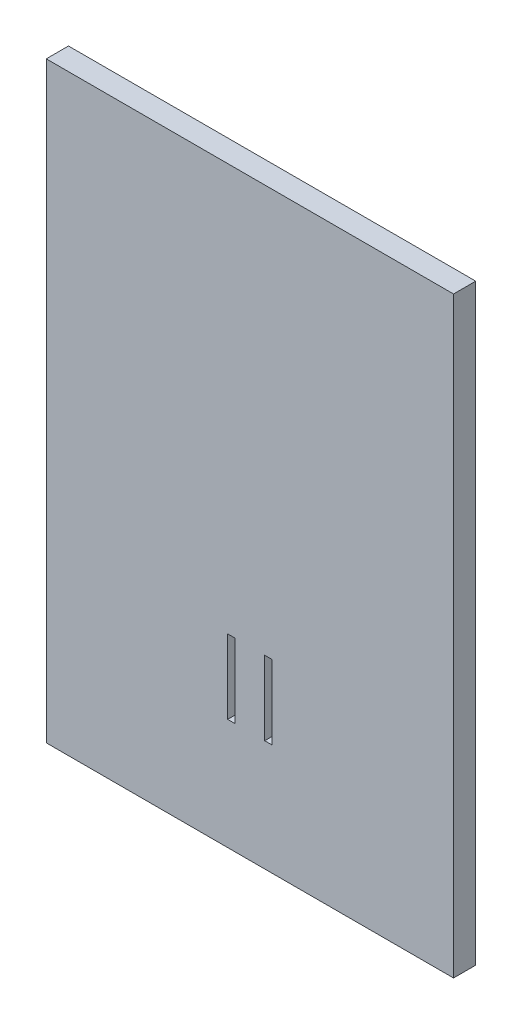
ISO-10303-21;
HEADER;
FILE_DESCRIPTION(('STEP AP214'),'2;1');
FILE_NAME('part.step','',(''),(''),'','','');
FILE_SCHEMA(('AUTOMOTIVE_DESIGN { 1 0 10303 214 1 1 1 1 }'));
ENDSEC;
DATA;
#1=APPLICATION_CONTEXT('core data for automotive mechanical design processes');
#2=APPLICATION_PROTOCOL_DEFINITION('international standard','automotive_design',2000,#1);
#3=PRODUCT_CONTEXT('',#1,'mechanical');
#4=PRODUCT('Part','Part','',(#3));
#5=PRODUCT_RELATED_PRODUCT_CATEGORY('part','',(#4));
#6=PRODUCT_DEFINITION_FORMATION('','',#4);
#7=PRODUCT_DEFINITION_CONTEXT('part definition',#1,'design');
#8=PRODUCT_DEFINITION('design','',#6,#7);
#9=PRODUCT_DEFINITION_SHAPE('','',#8);
#10=(LENGTH_UNIT() NAMED_UNIT(*) SI_UNIT(.MILLI.,.METRE.));
#11=(NAMED_UNIT(*) PLANE_ANGLE_UNIT() SI_UNIT($,.RADIAN.));
#12=(NAMED_UNIT(*) SI_UNIT($,.STERADIAN.) SOLID_ANGLE_UNIT());
#13=UNCERTAINTY_MEASURE_WITH_UNIT(LENGTH_MEASURE(1.E-05),#10,'distance_accuracy_value','');
#14=(GEOMETRIC_REPRESENTATION_CONTEXT(3) GLOBAL_UNCERTAINTY_ASSIGNED_CONTEXT((#13)) GLOBAL_UNIT_ASSIGNED_CONTEXT((#10,
#11,#12)) REPRESENTATION_CONTEXT('',''));
#15=CARTESIAN_POINT('',(0.,0.,0.));
#16=DIRECTION('',(0.,0.,1.));
#17=DIRECTION('',(1.,0.,0.));
#18=AXIS2_PLACEMENT_3D('',#15,#16,#17);
#19=CARTESIAN_POINT('',(0.,0.,3.));
#20=DIRECTION('',(0.,0.,1.));
#21=DIRECTION('',(1.,0.,0.));
#22=AXIS2_PLACEMENT_3D('',#19,#20,#21);
#23=PLANE('',#22);
#24=DIRECTION('',(-1.,0.,0.));
#25=VECTOR('',#24,1.);
#26=CARTESIAN_POINT('',(-1.99999999999999,-15.,3.));
#27=LINE('',#26,#25);
#28=CARTESIAN_POINT('',(-1.99999999999999,-15.,3.));
#29=VERTEX_POINT('',#28);
#30=CARTESIAN_POINT('',(-2.99999999999999,-15.,3.));
#31=VERTEX_POINT('',#30);
#32=EDGE_CURVE('E160',#29,#31,#27,.T.);
#33=ORIENTED_EDGE('',*,*,#32,.F.);
#34=DIRECTION('',(0.,1.,0.));
#35=VECTOR('',#34,1.);
#36=CARTESIAN_POINT('',(-1.99999999999999,-15.,3.));
#37=LINE('',#36,#35);
#38=CARTESIAN_POINT('',(-1.99999999999999,-25.,3.));
#39=VERTEX_POINT('',#38);
#40=EDGE_CURVE('E158',#39,#29,#37,.T.);
#41=ORIENTED_EDGE('',*,*,#40,.F.);
#42=DIRECTION('',(1.,0.,0.));
#43=VECTOR('',#42,1.);
#44=CARTESIAN_POINT('',(-1.99999999999999,-25.,3.));
#45=LINE('',#44,#43);
#46=CARTESIAN_POINT('',(-2.99999999999999,-25.,3.));
#47=VERTEX_POINT('',#46);
#48=EDGE_CURVE('E166',#47,#39,#45,.T.);
#49=ORIENTED_EDGE('',*,*,#48,.F.);
#50=DIRECTION('',(0.,-1.,0.));
#51=VECTOR('',#50,1.);
#52=CARTESIAN_POINT('',(-2.99999999999999,-15.,3.));
#53=LINE('',#52,#51);
#54=EDGE_CURVE('E163',#31,#47,#53,.T.);
#55=ORIENTED_EDGE('',*,*,#54,.F.);
#56=EDGE_LOOP('',(#33,#41,#49,#55));
#57=FACE_BOUND('',#56,.T.);
#58=DIRECTION('',(0.,-1.,0.));
#59=VECTOR('',#58,1.);
#60=CARTESIAN_POINT('',(-27.5,40.,3.));
#61=LINE('',#60,#59);
#62=CARTESIAN_POINT('',(-27.5,40.,3.));
#63=VERTEX_POINT('',#62);
#64=CARTESIAN_POINT('',(-27.5,-40.,3.));
#65=VERTEX_POINT('',#64);
#66=EDGE_CURVE('E189',#63,#65,#61,.T.);
#67=ORIENTED_EDGE('',*,*,#66,.T.);
#68=DIRECTION('',(1.,0.,0.));
#69=VECTOR('',#68,1.);
#70=CARTESIAN_POINT('',(-27.5,-40.,3.));
#71=LINE('',#70,#69);
#72=CARTESIAN_POINT('',(27.5,-40.,3.));
#73=VERTEX_POINT('',#72);
#74=EDGE_CURVE('E192',#65,#73,#71,.T.);
#75=ORIENTED_EDGE('',*,*,#74,.T.);
#76=DIRECTION('',(0.,1.,0.));
#77=VECTOR('',#76,1.);
#78=CARTESIAN_POINT('',(27.5,40.,3.));
#79=LINE('',#78,#77);
#80=CARTESIAN_POINT('',(27.5,40.,3.));
#81=VERTEX_POINT('',#80);
#82=EDGE_CURVE('E195',#73,#81,#79,.T.);
#83=ORIENTED_EDGE('',*,*,#82,.T.);
#84=DIRECTION('',(-1.,0.,0.));
#85=VECTOR('',#84,1.);
#86=CARTESIAN_POINT('',(-27.5,40.,3.));
#87=LINE('',#86,#85);
#88=EDGE_CURVE('E197',#81,#63,#87,.T.);
#89=ORIENTED_EDGE('',*,*,#88,.T.);
#90=EDGE_LOOP('',(#67,#75,#83,#89));
#91=FACE_BOUND('',#90,.T.);
#92=DIRECTION('',(1.,0.,0.));
#93=VECTOR('',#92,1.);
#94=CARTESIAN_POINT('',(2.00000000000001,-25.,3.));
#95=LINE('',#94,#93);
#96=CARTESIAN_POINT('',(2.00000000000001,-25.,3.));
#97=VERTEX_POINT('',#96);
#98=CARTESIAN_POINT('',(3.00000000000001,-25.,3.));
#99=VERTEX_POINT('',#98);
#100=EDGE_CURVE('E130',#97,#99,#95,.T.);
#101=ORIENTED_EDGE('',*,*,#100,.F.);
#102=DIRECTION('',(0.,-1.,0.));
#103=VECTOR('',#102,1.);
#104=CARTESIAN_POINT('',(2.00000000000001,-15.,3.));
#105=LINE('',#104,#103);
#106=CARTESIAN_POINT('',(2.00000000000001,-15.,3.));
#107=VERTEX_POINT('',#106);
#108=EDGE_CURVE('E122',#107,#97,#105,.T.);
#109=ORIENTED_EDGE('',*,*,#108,.F.);
#110=DIRECTION('',(-1.,0.,0.));
#111=VECTOR('',#110,1.);
#112=CARTESIAN_POINT('',(2.00000000000001,-15.,3.));
#113=LINE('',#112,#111);
#114=CARTESIAN_POINT('',(3.00000000000001,-15.,3.));
#115=VERTEX_POINT('',#114);
#116=EDGE_CURVE('E144',#115,#107,#113,.T.);
#117=ORIENTED_EDGE('',*,*,#116,.F.);
#118=DIRECTION('',(0.,1.,0.));
#119=VECTOR('',#118,1.);
#120=CARTESIAN_POINT('',(3.00000000000001,-15.,3.));
#121=LINE('',#120,#119);
#122=EDGE_CURVE('E142',#99,#115,#121,.T.);
#123=ORIENTED_EDGE('',*,*,#122,.F.);
#124=EDGE_LOOP('',(#101,#109,#117,#123));
#125=FACE_BOUND('',#124,.T.);
#126=ADVANCED_FACE('F33',(#57,#91,#125),#23,.T.);
#127=CARTESIAN_POINT('',(0.,0.,0.));
#128=DIRECTION('',(0.,0.,1.));
#129=DIRECTION('',(1.,0.,0.));
#130=AXIS2_PLACEMENT_3D('',#127,#128,#129);
#131=PLANE('',#130);
#132=DIRECTION('',(0.,1.,0.));
#133=VECTOR('',#132,1.);
#134=CARTESIAN_POINT('',(-1.99999999999999,-15.,0.));
#135=LINE('',#134,#133);
#136=CARTESIAN_POINT('',(-1.99999999999999,-25.,0.));
#137=VERTEX_POINT('',#136);
#138=CARTESIAN_POINT('',(-1.99999999999999,-15.,0.));
#139=VERTEX_POINT('',#138);
#140=EDGE_CURVE('E138',#137,#139,#135,.T.);
#141=ORIENTED_EDGE('',*,*,#140,.T.);
#142=DIRECTION('',(-1.,0.,0.));
#143=VECTOR('',#142,1.);
#144=CARTESIAN_POINT('',(-1.99999999999999,-15.,0.));
#145=LINE('',#144,#143);
#146=CARTESIAN_POINT('',(-2.99999999999999,-15.,0.));
#147=VERTEX_POINT('',#146);
#148=EDGE_CURVE('E171',#139,#147,#145,.T.);
#149=ORIENTED_EDGE('',*,*,#148,.T.);
#150=DIRECTION('',(0.,-1.,0.));
#151=VECTOR('',#150,1.);
#152=CARTESIAN_POINT('',(-2.99999999999999,-15.,0.));
#153=LINE('',#152,#151);
#154=CARTESIAN_POINT('',(-2.99999999999999,-25.,0.));
#155=VERTEX_POINT('',#154);
#156=EDGE_CURVE('E174',#147,#155,#153,.T.);
#157=ORIENTED_EDGE('',*,*,#156,.T.);
#158=DIRECTION('',(1.,0.,0.));
#159=VECTOR('',#158,1.);
#160=CARTESIAN_POINT('',(-1.99999999999999,-25.,0.));
#161=LINE('',#160,#159);
#162=EDGE_CURVE('E161',#155,#137,#161,.T.);
#163=ORIENTED_EDGE('',*,*,#162,.T.);
#164=EDGE_LOOP('',(#141,#149,#157,#163));
#165=FACE_BOUND('',#164,.T.);
#166=DIRECTION('',(0.,-1.,0.));
#167=VECTOR('',#166,1.);
#168=CARTESIAN_POINT('',(-27.5,40.,0.));
#169=LINE('',#168,#167);
#170=CARTESIAN_POINT('',(-27.5,40.,0.));
#171=VERTEX_POINT('',#170);
#172=CARTESIAN_POINT('',(-27.5,-40.,0.));
#173=VERTEX_POINT('',#172);
#174=EDGE_CURVE('E188',#171,#173,#169,.T.);
#175=ORIENTED_EDGE('',*,*,#174,.F.);
#176=DIRECTION('',(-1.,0.,0.));
#177=VECTOR('',#176,1.);
#178=CARTESIAN_POINT('',(-27.5,40.,0.));
#179=LINE('',#178,#177);
#180=CARTESIAN_POINT('',(27.5,40.,0.));
#181=VERTEX_POINT('',#180);
#182=EDGE_CURVE('E193',#181,#171,#179,.T.);
#183=ORIENTED_EDGE('',*,*,#182,.F.);
#184=DIRECTION('',(0.,1.,0.));
#185=VECTOR('',#184,1.);
#186=CARTESIAN_POINT('',(27.5,40.,0.));
#187=LINE('',#186,#185);
#188=CARTESIAN_POINT('',(27.5,-40.,0.));
#189=VERTEX_POINT('',#188);
#190=EDGE_CURVE('E204',#189,#181,#187,.T.);
#191=ORIENTED_EDGE('',*,*,#190,.F.);
#192=DIRECTION('',(1.,0.,0.));
#193=VECTOR('',#192,1.);
#194=CARTESIAN_POINT('',(-27.5,-40.,0.));
#195=LINE('',#194,#193);
#196=EDGE_CURVE('E202',#173,#189,#195,.T.);
#197=ORIENTED_EDGE('',*,*,#196,.F.);
#198=EDGE_LOOP('',(#175,#183,#191,#197));
#199=FACE_BOUND('',#198,.T.);
#200=DIRECTION('',(0.,-1.,0.));
#201=VECTOR('',#200,1.);
#202=CARTESIAN_POINT('',(2.00000000000001,-15.,0.));
#203=LINE('',#202,#201);
#204=CARTESIAN_POINT('',(2.00000000000001,-15.,0.));
#205=VERTEX_POINT('',#204);
#206=CARTESIAN_POINT('',(2.00000000000001,-25.,0.));
#207=VERTEX_POINT('',#206);
#208=EDGE_CURVE('E56',#205,#207,#203,.T.);
#209=ORIENTED_EDGE('',*,*,#208,.T.);
#210=DIRECTION('',(1.,0.,0.));
#211=VECTOR('',#210,1.);
#212=CARTESIAN_POINT('',(2.00000000000001,-25.,0.));
#213=LINE('',#212,#211);
#214=CARTESIAN_POINT('',(3.00000000000001,-25.,0.));
#215=VERTEX_POINT('',#214);
#216=EDGE_CURVE('E137',#207,#215,#213,.T.);
#217=ORIENTED_EDGE('',*,*,#216,.T.);
#218=DIRECTION('',(0.,1.,0.));
#219=VECTOR('',#218,1.);
#220=CARTESIAN_POINT('',(3.00000000000001,-15.,0.));
#221=LINE('',#220,#219);
#222=CARTESIAN_POINT('',(3.00000000000001,-15.,0.));
#223=VERTEX_POINT('',#222);
#224=EDGE_CURVE('E150',#215,#223,#221,.T.);
#225=ORIENTED_EDGE('',*,*,#224,.T.);
#226=DIRECTION('',(-1.,0.,0.));
#227=VECTOR('',#226,1.);
#228=CARTESIAN_POINT('',(2.00000000000001,-15.,0.));
#229=LINE('',#228,#227);
#230=EDGE_CURVE('E131',#223,#205,#229,.T.);
#231=ORIENTED_EDGE('',*,*,#230,.T.);
#232=EDGE_LOOP('',(#209,#217,#225,#231));
#233=FACE_BOUND('',#232,.T.);
#234=ADVANCED_FACE('F222',(#165,#199,#233),#131,.F.);
#235=CARTESIAN_POINT('',(-27.5,40.,3.));
#236=DIRECTION('',(1.,0.,0.));
#237=DIRECTION('',(0.,1.,0.));
#238=AXIS2_PLACEMENT_3D('',#235,#236,#237);
#239=PLANE('',#238);
#240=ORIENTED_EDGE('',*,*,#174,.T.);
#241=DIRECTION('',(0.,0.,-1.));
#242=VECTOR('',#241,1.);
#243=CARTESIAN_POINT('',(-27.5,-40.,3.));
#244=LINE('',#243,#242);
#245=EDGE_CURVE('E11',#65,#173,#244,.T.);
#246=ORIENTED_EDGE('',*,*,#245,.F.);
#247=ORIENTED_EDGE('',*,*,#66,.F.);
#248=DIRECTION('',(0.,0.,-1.));
#249=VECTOR('',#248,1.);
#250=CARTESIAN_POINT('',(-27.5,40.,3.));
#251=LINE('',#250,#249);
#252=EDGE_CURVE('E199',#63,#171,#251,.T.);
#253=ORIENTED_EDGE('',*,*,#252,.T.);
#254=EDGE_LOOP('',(#240,#246,#247,#253));
#255=FACE_BOUND('',#254,.T.);
#256=ADVANCED_FACE('F35',(#255),#239,.F.);
#257=CARTESIAN_POINT('',(-27.5,-40.,3.));
#258=DIRECTION('',(0.,1.,0.));
#259=DIRECTION('',(0.,0.,1.));
#260=AXIS2_PLACEMENT_3D('',#257,#258,#259);
#261=PLANE('',#260);
#262=ORIENTED_EDGE('',*,*,#196,.T.);
#263=DIRECTION('',(0.,0.,-1.));
#264=VECTOR('',#263,1.);
#265=CARTESIAN_POINT('',(27.5,-40.,3.));
#266=LINE('',#265,#264);
#267=EDGE_CURVE('E41',#73,#189,#266,.T.);
#268=ORIENTED_EDGE('',*,*,#267,.F.);
#269=ORIENTED_EDGE('',*,*,#74,.F.);
#270=ORIENTED_EDGE('',*,*,#245,.T.);
#271=EDGE_LOOP('',(#262,#268,#269,#270));
#272=FACE_BOUND('',#271,.T.);
#273=ADVANCED_FACE('F232',(#272),#261,.F.);
#274=CARTESIAN_POINT('',(27.5,40.,3.));
#275=DIRECTION('',(-1.,0.,0.));
#276=DIRECTION('',(0.,-1.,0.));
#277=AXIS2_PLACEMENT_3D('',#274,#275,#276);
#278=PLANE('',#277);
#279=ORIENTED_EDGE('',*,*,#190,.T.);
#280=DIRECTION('',(0.,0.,-1.));
#281=VECTOR('',#280,1.);
#282=CARTESIAN_POINT('',(27.5,40.,3.));
#283=LINE('',#282,#281);
#284=EDGE_CURVE('E209',#81,#181,#283,.T.);
#285=ORIENTED_EDGE('',*,*,#284,.F.);
#286=ORIENTED_EDGE('',*,*,#82,.F.);
#287=ORIENTED_EDGE('',*,*,#267,.T.);
#288=EDGE_LOOP('',(#279,#285,#286,#287));
#289=FACE_BOUND('',#288,.T.);
#290=ADVANCED_FACE('F216',(#289),#278,.F.);
#291=CARTESIAN_POINT('',(-27.5,40.,3.));
#292=DIRECTION('',(0.,-1.,0.));
#293=DIRECTION('',(0.,0.,-1.));
#294=AXIS2_PLACEMENT_3D('',#291,#292,#293);
#295=PLANE('',#294);
#296=ORIENTED_EDGE('',*,*,#182,.T.);
#297=ORIENTED_EDGE('',*,*,#252,.F.);
#298=ORIENTED_EDGE('',*,*,#88,.F.);
#299=ORIENTED_EDGE('',*,*,#284,.T.);
#300=EDGE_LOOP('',(#296,#297,#298,#299));
#301=FACE_BOUND('',#300,.T.);
#302=ADVANCED_FACE('F226',(#301),#295,.F.);
#303=CARTESIAN_POINT('',(-1.99999999999999,-15.,3.));
#304=DIRECTION('',(-1.,0.,0.));
#305=DIRECTION('',(0.,-1.,0.));
#306=AXIS2_PLACEMENT_3D('',#303,#304,#305);
#307=PLANE('',#306);
#308=ORIENTED_EDGE('',*,*,#140,.F.);
#309=DIRECTION('',(0.,0.,-1.));
#310=VECTOR('',#309,1.);
#311=CARTESIAN_POINT('',(-1.99999999999999,-25.,3.));
#312=LINE('',#311,#310);
#313=EDGE_CURVE('E168',#39,#137,#312,.T.);
#314=ORIENTED_EDGE('',*,*,#313,.F.);
#315=ORIENTED_EDGE('',*,*,#40,.T.);
#316=DIRECTION('',(0.,0.,-1.));
#317=VECTOR('',#316,1.);
#318=CARTESIAN_POINT('',(-1.99999999999999,-15.,3.));
#319=LINE('',#318,#317);
#320=EDGE_CURVE('E185',#29,#139,#319,.T.);
#321=ORIENTED_EDGE('',*,*,#320,.T.);
#322=EDGE_LOOP('',(#308,#314,#315,#321));
#323=FACE_BOUND('',#322,.T.);
#324=ADVANCED_FACE('F249',(#323),#307,.T.);
#325=CARTESIAN_POINT('',(-1.99999999999999,-15.,3.));
#326=DIRECTION('',(0.,-1.,0.));
#327=DIRECTION('',(0.,0.,-1.));
#328=AXIS2_PLACEMENT_3D('',#325,#326,#327);
#329=PLANE('',#328);
#330=ORIENTED_EDGE('',*,*,#148,.F.);
#331=ORIENTED_EDGE('',*,*,#320,.F.);
#332=ORIENTED_EDGE('',*,*,#32,.T.);
#333=DIRECTION('',(0.,0.,-1.));
#334=VECTOR('',#333,1.);
#335=CARTESIAN_POINT('',(-2.99999999999999,-15.,3.));
#336=LINE('',#335,#334);
#337=EDGE_CURVE('E183',#31,#147,#336,.T.);
#338=ORIENTED_EDGE('',*,*,#337,.T.);
#339=EDGE_LOOP('',(#330,#331,#332,#338));
#340=FACE_BOUND('',#339,.T.);
#341=ADVANCED_FACE('F256',(#340),#329,.T.);
#342=CARTESIAN_POINT('',(-2.99999999999999,-15.,3.));
#343=DIRECTION('',(1.,0.,0.));
#344=DIRECTION('',(0.,1.,0.));
#345=AXIS2_PLACEMENT_3D('',#342,#343,#344);
#346=PLANE('',#345);
#347=ORIENTED_EDGE('',*,*,#156,.F.);
#348=ORIENTED_EDGE('',*,*,#337,.F.);
#349=ORIENTED_EDGE('',*,*,#54,.T.);
#350=DIRECTION('',(0.,0.,-1.));
#351=VECTOR('',#350,1.);
#352=CARTESIAN_POINT('',(-2.99999999999999,-25.,3.));
#353=LINE('',#352,#351);
#354=EDGE_CURVE('E181',#47,#155,#353,.T.);
#355=ORIENTED_EDGE('',*,*,#354,.T.);
#356=EDGE_LOOP('',(#347,#348,#349,#355));
#357=FACE_BOUND('',#356,.T.);
#358=ADVANCED_FACE('F261',(#357),#346,.T.);
#359=CARTESIAN_POINT('',(-1.99999999999999,-25.,3.));
#360=DIRECTION('',(0.,1.,0.));
#361=DIRECTION('',(0.,0.,1.));
#362=AXIS2_PLACEMENT_3D('',#359,#360,#361);
#363=PLANE('',#362);
#364=ORIENTED_EDGE('',*,*,#162,.F.);
#365=ORIENTED_EDGE('',*,*,#354,.F.);
#366=ORIENTED_EDGE('',*,*,#48,.T.);
#367=ORIENTED_EDGE('',*,*,#313,.T.);
#368=EDGE_LOOP('',(#364,#365,#366,#367));
#369=FACE_BOUND('',#368,.T.);
#370=ADVANCED_FACE('F268',(#369),#363,.T.);
#371=CARTESIAN_POINT('',(2.00000000000001,-15.,3.));
#372=DIRECTION('',(1.,0.,0.));
#373=DIRECTION('',(0.,1.,0.));
#374=AXIS2_PLACEMENT_3D('',#371,#372,#373);
#375=PLANE('',#374);
#376=ORIENTED_EDGE('',*,*,#208,.F.);
#377=DIRECTION('',(0.,0.,-1.));
#378=VECTOR('',#377,1.);
#379=CARTESIAN_POINT('',(2.00000000000001,-15.,3.));
#380=LINE('',#379,#378);
#381=EDGE_CURVE('E126',#107,#205,#380,.T.);
#382=ORIENTED_EDGE('',*,*,#381,.F.);
#383=ORIENTED_EDGE('',*,*,#108,.T.);
#384=DIRECTION('',(0.,0.,-1.));
#385=VECTOR('',#384,1.);
#386=CARTESIAN_POINT('',(2.00000000000001,-25.,3.));
#387=LINE('',#386,#385);
#388=EDGE_CURVE('E125',#97,#207,#387,.T.);
#389=ORIENTED_EDGE('',*,*,#388,.T.);
#390=EDGE_LOOP('',(#376,#382,#383,#389));
#391=FACE_BOUND('',#390,.T.);
#392=ADVANCED_FACE('F124',(#391),#375,.T.);
#393=CARTESIAN_POINT('',(2.00000000000001,-25.,3.));
#394=DIRECTION('',(0.,1.,0.));
#395=DIRECTION('',(0.,0.,1.));
#396=AXIS2_PLACEMENT_3D('',#393,#394,#395);
#397=PLANE('',#396);
#398=ORIENTED_EDGE('',*,*,#216,.F.);
#399=ORIENTED_EDGE('',*,*,#388,.F.);
#400=ORIENTED_EDGE('',*,*,#100,.T.);
#401=DIRECTION('',(0.,0.,-1.));
#402=VECTOR('',#401,1.);
#403=CARTESIAN_POINT('',(3.00000000000001,-25.,3.));
#404=LINE('',#403,#402);
#405=EDGE_CURVE('E139',#99,#215,#404,.T.);
#406=ORIENTED_EDGE('',*,*,#405,.T.);
#407=EDGE_LOOP('',(#398,#399,#400,#406));
#408=FACE_BOUND('',#407,.T.);
#409=ADVANCED_FACE('F134',(#408),#397,.T.);
#410=CARTESIAN_POINT('',(3.00000000000001,-15.,3.));
#411=DIRECTION('',(-1.,0.,0.));
#412=DIRECTION('',(0.,-1.,0.));
#413=AXIS2_PLACEMENT_3D('',#410,#411,#412);
#414=PLANE('',#413);
#415=ORIENTED_EDGE('',*,*,#224,.F.);
#416=ORIENTED_EDGE('',*,*,#405,.F.);
#417=ORIENTED_EDGE('',*,*,#122,.T.);
#418=DIRECTION('',(0.,0.,-1.));
#419=VECTOR('',#418,1.);
#420=CARTESIAN_POINT('',(3.00000000000001,-15.,3.));
#421=LINE('',#420,#419);
#422=EDGE_CURVE('E48',#115,#223,#421,.T.);
#423=ORIENTED_EDGE('',*,*,#422,.T.);
#424=EDGE_LOOP('',(#415,#416,#417,#423));
#425=FACE_BOUND('',#424,.T.);
#426=ADVANCED_FACE('F285',(#425),#414,.T.);
#427=CARTESIAN_POINT('',(2.00000000000001,-15.,3.));
#428=DIRECTION('',(0.,-1.,0.));
#429=DIRECTION('',(0.,0.,-1.));
#430=AXIS2_PLACEMENT_3D('',#427,#428,#429);
#431=PLANE('',#430);
#432=ORIENTED_EDGE('',*,*,#230,.F.);
#433=ORIENTED_EDGE('',*,*,#422,.F.);
#434=ORIENTED_EDGE('',*,*,#116,.T.);
#435=ORIENTED_EDGE('',*,*,#381,.T.);
#436=EDGE_LOOP('',(#432,#433,#434,#435));
#437=FACE_BOUND('',#436,.T.);
#438=ADVANCED_FACE('F288',(#437),#431,.T.);
#439=CLOSED_SHELL('',(#126,#234,#256,#273,#290,#302,#324,#341,#358,#370,#392,#409,#426,#438));
#440=MANIFOLD_SOLID_BREP('B2',#439);
#441=ADVANCED_BREP_SHAPE_REPRESENTATION('',(#18,#440),#14);
#442=SHAPE_DEFINITION_REPRESENTATION(#9,#441);
ENDSEC;
END-ISO-10303-21;
